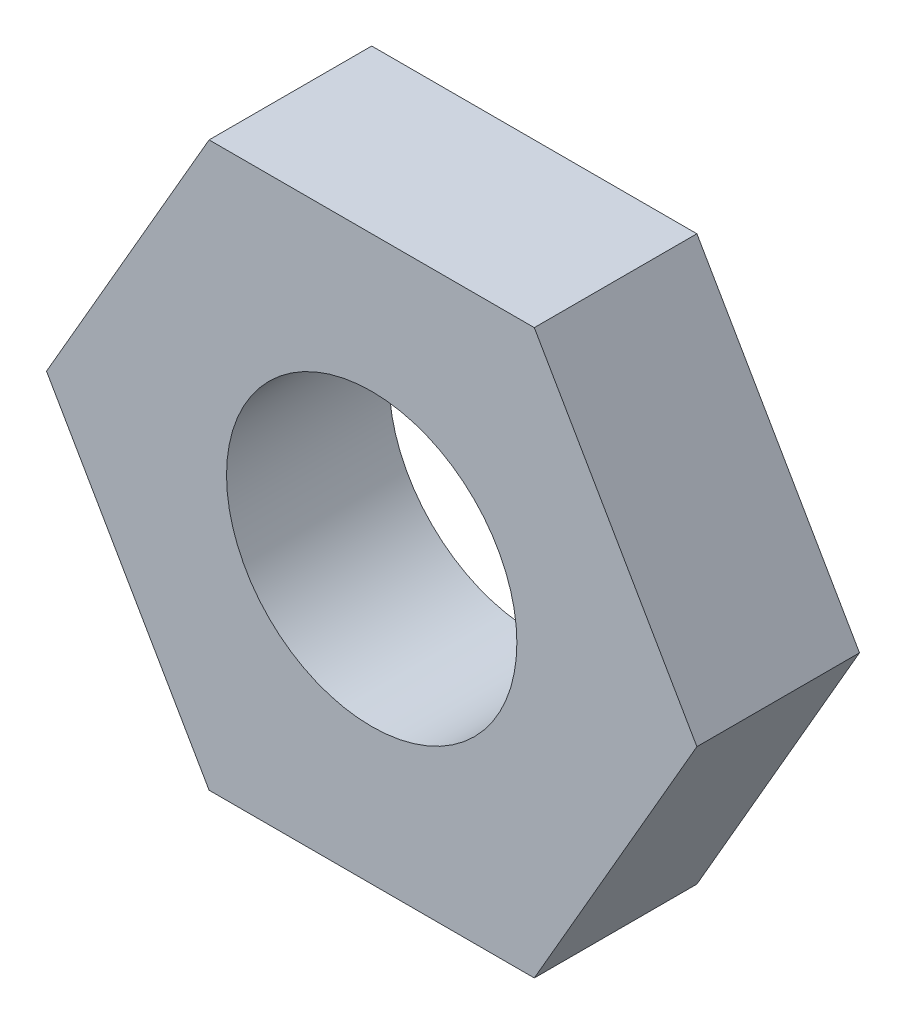
ISO-10303-21;
HEADER;
FILE_DESCRIPTION(('STEP AP214'),'2;1');
FILE_NAME('part.step','',(''),(''),'','','');
FILE_SCHEMA(('AUTOMOTIVE_DESIGN { 1 0 10303 214 1 1 1 1 }'));
ENDSEC;
DATA;
#1=APPLICATION_CONTEXT('core data for automotive mechanical design processes');
#2=APPLICATION_PROTOCOL_DEFINITION('international standard','automotive_design',2000,#1);
#3=PRODUCT_CONTEXT('',#1,'mechanical');
#4=PRODUCT('Part','Part','',(#3));
#5=PRODUCT_RELATED_PRODUCT_CATEGORY('part','',(#4));
#6=PRODUCT_DEFINITION_FORMATION('','',#4);
#7=PRODUCT_DEFINITION_CONTEXT('part definition',#1,'design');
#8=PRODUCT_DEFINITION('design','',#6,#7);
#9=PRODUCT_DEFINITION_SHAPE('','',#8);
#10=(LENGTH_UNIT() NAMED_UNIT(*) SI_UNIT(.MILLI.,.METRE.));
#11=(NAMED_UNIT(*) PLANE_ANGLE_UNIT() SI_UNIT($,.RADIAN.));
#12=(NAMED_UNIT(*) SI_UNIT($,.STERADIAN.) SOLID_ANGLE_UNIT());
#13=UNCERTAINTY_MEASURE_WITH_UNIT(LENGTH_MEASURE(1.E-05),#10,'distance_accuracy_value','');
#14=(GEOMETRIC_REPRESENTATION_CONTEXT(3) GLOBAL_UNCERTAINTY_ASSIGNED_CONTEXT((#13)) GLOBAL_UNIT_ASSIGNED_CONTEXT((#10,
#11,#12)) REPRESENTATION_CONTEXT('',''));
#15=CARTESIAN_POINT('',(0.,0.,0.));
#16=DIRECTION('',(0.,0.,1.));
#17=DIRECTION('',(1.,0.,0.));
#18=AXIS2_PLACEMENT_3D('',#15,#16,#17);
#19=CARTESIAN_POINT('',(0.,0.,3.556));
#20=DIRECTION('',(0.,0.,1.));
#21=DIRECTION('',(1.,0.,0.));
#22=AXIS2_PLACEMENT_3D('',#19,#20,#21);
#23=PLANE('',#22);
#24=DIRECTION('',(-0.5,-0.866025403784439,0.));
#25=VECTOR('',#24,1.);
#26=CARTESIAN_POINT('',(-3.556,6.15917267171493,3.556));
#27=LINE('',#26,#25);
#28=CARTESIAN_POINT('',(-3.556,6.15917267171493,3.556));
#29=VERTEX_POINT('',#28);
#30=CARTESIAN_POINT('',(-7.112,0.,3.556));
#31=VERTEX_POINT('',#30);
#32=EDGE_CURVE('E131',#29,#31,#27,.T.);
#33=ORIENTED_EDGE('',*,*,#32,.T.);
#34=DIRECTION('',(0.5,-0.866025403784439,0.));
#35=VECTOR('',#34,1.);
#36=CARTESIAN_POINT('',(-7.112,0.,3.556));
#37=LINE('',#36,#35);
#38=CARTESIAN_POINT('',(-3.556,-6.15917267171493,3.556));
#39=VERTEX_POINT('',#38);
#40=EDGE_CURVE('E89',#31,#39,#37,.T.);
#41=ORIENTED_EDGE('',*,*,#40,.T.);
#42=DIRECTION('',(1.,0.,0.));
#43=VECTOR('',#42,1.);
#44=CARTESIAN_POINT('',(-3.556,-6.15917267171493,3.556));
#45=LINE('',#44,#43);
#46=CARTESIAN_POINT('',(3.556,-6.15917267171493,3.556));
#47=VERTEX_POINT('',#46);
#48=EDGE_CURVE('E102',#39,#47,#45,.T.);
#49=ORIENTED_EDGE('',*,*,#48,.T.);
#50=DIRECTION('',(0.5,0.866025403784439,0.));
#51=VECTOR('',#50,1.);
#52=CARTESIAN_POINT('',(3.556,-6.15917267171493,3.556));
#53=LINE('',#52,#51);
#54=CARTESIAN_POINT('',(7.112,0.,3.556));
#55=VERTEX_POINT('',#54);
#56=EDGE_CURVE('E96',#47,#55,#53,.T.);
#57=ORIENTED_EDGE('',*,*,#56,.T.);
#58=DIRECTION('',(-0.5,0.866025403784439,0.));
#59=VECTOR('',#58,1.);
#60=CARTESIAN_POINT('',(7.112,0.,3.556));
#61=LINE('',#60,#59);
#62=CARTESIAN_POINT('',(3.556,6.15917267171493,3.556));
#63=VERTEX_POINT('',#62);
#64=EDGE_CURVE('E100',#55,#63,#61,.T.);
#65=ORIENTED_EDGE('',*,*,#64,.T.);
#66=DIRECTION('',(-1.,0.,0.));
#67=VECTOR('',#66,1.);
#68=CARTESIAN_POINT('',(3.556,6.15917267171493,3.556));
#69=LINE('',#68,#67);
#70=EDGE_CURVE('E52',#63,#29,#69,.T.);
#71=ORIENTED_EDGE('',*,*,#70,.T.);
#72=EDGE_LOOP('',(#33,#41,#49,#57,#65,#71));
#73=FACE_BOUND('',#72,.T.);
#74=CARTESIAN_POINT('',(0.,0.,3.556));
#75=DIRECTION('',(0.,0.,1.));
#76=DIRECTION('',(1.,0.,0.));
#77=AXIS2_PLACEMENT_3D('',#74,#75,#76);
#78=CIRCLE('',#77,3.175);
#79=CARTESIAN_POINT('',(3.175,0.,3.556));
#80=VERTEX_POINT('',#79);
#81=EDGE_CURVE('E124',#80,#80,#78,.T.);
#82=ORIENTED_EDGE('',*,*,#81,.F.);
#83=EDGE_LOOP('',(#82));
#84=FACE_BOUND('',#83,.T.);
#85=ADVANCED_FACE('F35',(#73,#84),#23,.T.);
#86=CARTESIAN_POINT('',(0.,0.,0.));
#87=DIRECTION('',(0.,0.,1.));
#88=DIRECTION('',(1.,0.,0.));
#89=AXIS2_PLACEMENT_3D('',#86,#87,#88);
#90=PLANE('',#89);
#91=DIRECTION('',(-0.5,-0.866025403784439,0.));
#92=VECTOR('',#91,1.);
#93=CARTESIAN_POINT('',(-3.556,6.15917267171493,0.));
#94=LINE('',#93,#92);
#95=CARTESIAN_POINT('',(-3.556,6.15917267171493,0.));
#96=VERTEX_POINT('',#95);
#97=CARTESIAN_POINT('',(-7.112,0.,0.));
#98=VERTEX_POINT('',#97);
#99=EDGE_CURVE('E120',#96,#98,#94,.T.);
#100=ORIENTED_EDGE('',*,*,#99,.F.);
#101=DIRECTION('',(-1.,0.,0.));
#102=VECTOR('',#101,1.);
#103=CARTESIAN_POINT('',(3.556,6.15917267171493,0.));
#104=LINE('',#103,#102);
#105=CARTESIAN_POINT('',(3.556,6.15917267171493,0.));
#106=VERTEX_POINT('',#105);
#107=EDGE_CURVE('E81',#106,#96,#104,.T.);
#108=ORIENTED_EDGE('',*,*,#107,.F.);
#109=DIRECTION('',(-0.5,0.866025403784439,0.));
#110=VECTOR('',#109,1.);
#111=CARTESIAN_POINT('',(7.112,0.,0.));
#112=LINE('',#111,#110);
#113=CARTESIAN_POINT('',(7.112,0.,0.));
#114=VERTEX_POINT('',#113);
#115=EDGE_CURVE('E75',#114,#106,#112,.T.);
#116=ORIENTED_EDGE('',*,*,#115,.F.);
#117=DIRECTION('',(0.5,0.866025403784439,0.));
#118=VECTOR('',#117,1.);
#119=CARTESIAN_POINT('',(3.556,-6.15917267171493,0.));
#120=LINE('',#119,#118);
#121=CARTESIAN_POINT('',(3.556,-6.15917267171493,0.));
#122=VERTEX_POINT('',#121);
#123=EDGE_CURVE('E110',#122,#114,#120,.T.);
#124=ORIENTED_EDGE('',*,*,#123,.F.);
#125=DIRECTION('',(1.,0.,0.));
#126=VECTOR('',#125,1.);
#127=CARTESIAN_POINT('',(-3.556,-6.15917267171493,0.));
#128=LINE('',#127,#126);
#129=CARTESIAN_POINT('',(-3.556,-6.15917267171493,0.));
#130=VERTEX_POINT('',#129);
#131=EDGE_CURVE('E126',#130,#122,#128,.T.);
#132=ORIENTED_EDGE('',*,*,#131,.F.);
#133=DIRECTION('',(0.5,-0.866025403784439,0.));
#134=VECTOR('',#133,1.);
#135=CARTESIAN_POINT('',(-7.112,0.,0.));
#136=LINE('',#135,#134);
#137=EDGE_CURVE('E123',#98,#130,#136,.T.);
#138=ORIENTED_EDGE('',*,*,#137,.F.);
#139=EDGE_LOOP('',(#100,#108,#116,#124,#132,#138));
#140=FACE_BOUND('',#139,.T.);
#141=CARTESIAN_POINT('',(0.,0.,0.));
#142=DIRECTION('',(0.,0.,1.));
#143=DIRECTION('',(1.,0.,0.));
#144=AXIS2_PLACEMENT_3D('',#141,#142,#143);
#145=CIRCLE('',#144,3.175);
#146=CARTESIAN_POINT('',(3.175,0.,0.));
#147=VERTEX_POINT('',#146);
#148=EDGE_CURVE('E224',#147,#147,#145,.T.);
#149=ORIENTED_EDGE('',*,*,#148,.T.);
#150=EDGE_LOOP('',(#149));
#151=FACE_BOUND('',#150,.T.);
#152=ADVANCED_FACE('F140',(#140,#151),#90,.F.);
#153=CARTESIAN_POINT('',(-3.556,6.15917267171493,3.556));
#154=DIRECTION('',(0.866025403784439,-0.5,0.));
#155=DIRECTION('',(0.5,0.866025403784439,0.));
#156=AXIS2_PLACEMENT_3D('',#153,#154,#155);
#157=PLANE('',#156);
#158=ORIENTED_EDGE('',*,*,#99,.T.);
#159=DIRECTION('',(0.,0.,-1.));
#160=VECTOR('',#159,1.);
#161=CARTESIAN_POINT('',(-7.112,0.,3.556));
#162=LINE('',#161,#160);
#163=EDGE_CURVE('E11',#31,#98,#162,.T.);
#164=ORIENTED_EDGE('',*,*,#163,.F.);
#165=ORIENTED_EDGE('',*,*,#32,.F.);
#166=DIRECTION('',(0.,0.,-1.));
#167=VECTOR('',#166,1.);
#168=CARTESIAN_POINT('',(-3.556,6.15917267171493,3.556));
#169=LINE('',#168,#167);
#170=EDGE_CURVE('E116',#29,#96,#169,.T.);
#171=ORIENTED_EDGE('',*,*,#170,.T.);
#172=EDGE_LOOP('',(#158,#164,#165,#171));
#173=FACE_BOUND('',#172,.T.);
#174=ADVANCED_FACE('F37',(#173),#157,.F.);
#175=CARTESIAN_POINT('',(-7.112,0.,3.556));
#176=DIRECTION('',(0.866025403784439,0.5,0.));
#177=DIRECTION('',(-0.5,0.866025403784439,0.));
#178=AXIS2_PLACEMENT_3D('',#175,#176,#177);
#179=PLANE('',#178);
#180=ORIENTED_EDGE('',*,*,#137,.T.);
#181=DIRECTION('',(0.,0.,-1.));
#182=VECTOR('',#181,1.);
#183=CARTESIAN_POINT('',(-3.556,-6.15917267171493,3.556));
#184=LINE('',#183,#182);
#185=EDGE_CURVE('E44',#39,#130,#184,.T.);
#186=ORIENTED_EDGE('',*,*,#185,.F.);
#187=ORIENTED_EDGE('',*,*,#40,.F.);
#188=ORIENTED_EDGE('',*,*,#163,.T.);
#189=EDGE_LOOP('',(#180,#186,#187,#188));
#190=FACE_BOUND('',#189,.T.);
#191=ADVANCED_FACE('F165',(#190),#179,.F.);
#192=CARTESIAN_POINT('',(-3.556,-6.15917267171493,3.556));
#193=DIRECTION('',(0.,1.,0.));
#194=DIRECTION('',(-1.,0.,0.));
#195=AXIS2_PLACEMENT_3D('',#192,#193,#194);
#196=PLANE('',#195);
#197=ORIENTED_EDGE('',*,*,#131,.T.);
#198=DIRECTION('',(0.,0.,-1.));
#199=VECTOR('',#198,1.);
#200=CARTESIAN_POINT('',(3.556,-6.15917267171493,3.556));
#201=LINE('',#200,#199);
#202=EDGE_CURVE('E111',#47,#122,#201,.T.);
#203=ORIENTED_EDGE('',*,*,#202,.F.);
#204=ORIENTED_EDGE('',*,*,#48,.F.);
#205=ORIENTED_EDGE('',*,*,#185,.T.);
#206=EDGE_LOOP('',(#197,#203,#204,#205));
#207=FACE_BOUND('',#206,.T.);
#208=ADVANCED_FACE('F137',(#207),#196,.F.);
#209=CARTESIAN_POINT('',(3.556,-6.15917267171493,3.556));
#210=DIRECTION('',(-0.866025403784439,0.5,0.));
#211=DIRECTION('',(-0.5,-0.866025403784439,0.));
#212=AXIS2_PLACEMENT_3D('',#209,#210,#211);
#213=PLANE('',#212);
#214=ORIENTED_EDGE('',*,*,#123,.T.);
#215=DIRECTION('',(0.,0.,-1.));
#216=VECTOR('',#215,1.);
#217=CARTESIAN_POINT('',(7.112,0.,3.556));
#218=LINE('',#217,#216);
#219=EDGE_CURVE('E107',#55,#114,#218,.T.);
#220=ORIENTED_EDGE('',*,*,#219,.F.);
#221=ORIENTED_EDGE('',*,*,#56,.F.);
#222=ORIENTED_EDGE('',*,*,#202,.T.);
#223=EDGE_LOOP('',(#214,#220,#221,#222));
#224=FACE_BOUND('',#223,.T.);
#225=ADVANCED_FACE('F108',(#224),#213,.F.);
#226=CARTESIAN_POINT('',(7.112,0.,3.556));
#227=DIRECTION('',(-0.866025403784439,-0.5,0.));
#228=DIRECTION('',(0.5,-0.866025403784439,0.));
#229=AXIS2_PLACEMENT_3D('',#226,#227,#228);
#230=PLANE('',#229);
#231=ORIENTED_EDGE('',*,*,#115,.T.);
#232=DIRECTION('',(0.,0.,-1.));
#233=VECTOR('',#232,1.);
#234=CARTESIAN_POINT('',(3.556,6.15917267171493,3.556));
#235=LINE('',#234,#233);
#236=EDGE_CURVE('E112',#63,#106,#235,.T.);
#237=ORIENTED_EDGE('',*,*,#236,.F.);
#238=ORIENTED_EDGE('',*,*,#64,.F.);
#239=ORIENTED_EDGE('',*,*,#219,.T.);
#240=EDGE_LOOP('',(#231,#237,#238,#239));
#241=FACE_BOUND('',#240,.T.);
#242=ADVANCED_FACE('F114',(#241),#230,.F.);
#243=CARTESIAN_POINT('',(3.556,6.15917267171493,3.556));
#244=DIRECTION('',(0.,-1.,0.));
#245=DIRECTION('',(0.,0.,-1.));
#246=AXIS2_PLACEMENT_3D('',#243,#244,#245);
#247=PLANE('',#246);
#248=ORIENTED_EDGE('',*,*,#107,.T.);
#249=ORIENTED_EDGE('',*,*,#170,.F.);
#250=ORIENTED_EDGE('',*,*,#70,.F.);
#251=ORIENTED_EDGE('',*,*,#236,.T.);
#252=EDGE_LOOP('',(#248,#249,#250,#251));
#253=FACE_BOUND('',#252,.T.);
#254=ADVANCED_FACE('F145',(#253),#247,.F.);
#255=CARTESIAN_POINT('',(0.,0.,3.556));
#256=DIRECTION('',(0.,0.,-1.));
#257=DIRECTION('',(-1.,0.,0.));
#258=AXIS2_PLACEMENT_3D('',#255,#256,#257);
#259=CYLINDRICAL_SURFACE('',#258,3.175);
#260=ORIENTED_EDGE('',*,*,#81,.T.);
#261=EDGE_LOOP('',(#260));
#262=FACE_BOUND('',#261,.T.);
#263=ORIENTED_EDGE('',*,*,#148,.F.);
#264=EDGE_LOOP('',(#263));
#265=FACE_BOUND('',#264,.T.);
#266=ADVANCED_FACE('F147',(#262,#265),#259,.F.);
#267=CLOSED_SHELL('',(#85,#152,#174,#191,#208,#225,#242,#254,#266));
#268=MANIFOLD_SOLID_BREP('B2',#267);
#269=ADVANCED_BREP_SHAPE_REPRESENTATION('',(#18,#268),#14);
#270=SHAPE_DEFINITION_REPRESENTATION(#9,#269);
ENDSEC;
END-ISO-10303-21;
